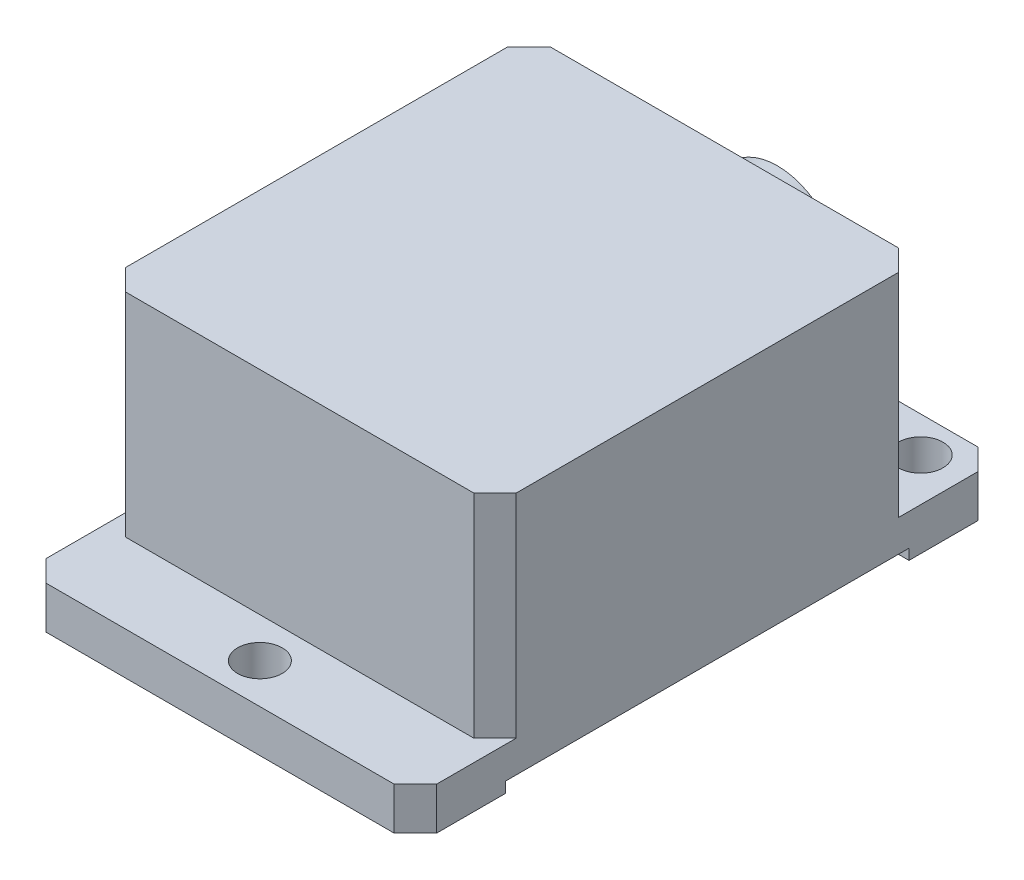
ISO-10303-21;
HEADER;
FILE_DESCRIPTION(('STEP AP214'),'2;1');
FILE_NAME('part.step','',(''),(''),'','','');
FILE_SCHEMA(('AUTOMOTIVE_DESIGN { 1 0 10303 214 1 1 1 1 }'));
ENDSEC;
DATA;
#1=APPLICATION_CONTEXT('core data for automotive mechanical design processes');
#2=APPLICATION_PROTOCOL_DEFINITION('international standard','automotive_design',2000,#1);
#3=PRODUCT_CONTEXT('',#1,'mechanical');
#4=PRODUCT('Part','Part','',(#3));
#5=PRODUCT_RELATED_PRODUCT_CATEGORY('part','',(#4));
#6=PRODUCT_DEFINITION_FORMATION('','',#4);
#7=PRODUCT_DEFINITION_CONTEXT('part definition',#1,'design');
#8=PRODUCT_DEFINITION('design','',#6,#7);
#9=PRODUCT_DEFINITION_SHAPE('','',#8);
#10=(LENGTH_UNIT() NAMED_UNIT(*) SI_UNIT(.MILLI.,.METRE.));
#11=(NAMED_UNIT(*) PLANE_ANGLE_UNIT() SI_UNIT($,.RADIAN.));
#12=(NAMED_UNIT(*) SI_UNIT($,.STERADIAN.) SOLID_ANGLE_UNIT());
#13=UNCERTAINTY_MEASURE_WITH_UNIT(LENGTH_MEASURE(1.E-05),#10,'distance_accuracy_value','');
#14=(GEOMETRIC_REPRESENTATION_CONTEXT(3) GLOBAL_UNCERTAINTY_ASSIGNED_CONTEXT((#13)) GLOBAL_UNIT_ASSIGNED_CONTEXT((#10,
#11,#12)) REPRESENTATION_CONTEXT('',''));
#15=CARTESIAN_POINT('',(0.,0.,0.));
#16=DIRECTION('',(0.,0.,1.));
#17=DIRECTION('',(1.,0.,0.));
#18=AXIS2_PLACEMENT_3D('',#15,#16,#17);
#19=CARTESIAN_POINT('',(0.,0.,0.));
#20=DIRECTION('',(0.,-1.,0.));
#21=DIRECTION('',(0.,0.,-1.));
#22=AXIS2_PLACEMENT_3D('',#19,#20,#21);
#23=PLANE('',#22);
#24=CARTESIAN_POINT('',(18.4,0.,-3.75));
#25=DIRECTION('',(0.,1.,0.));
#26=DIRECTION('',(0.,0.,1.));
#27=AXIS2_PLACEMENT_3D('',#24,#25,#26);
#28=CIRCLE('',#27,2.1);
#29=CARTESIAN_POINT('',(18.4,0.,-1.65));
#30=VERTEX_POINT('',#29);
#31=EDGE_CURVE('E370',#30,#30,#28,.T.);
#32=ORIENTED_EDGE('',*,*,#31,.T.);
#33=EDGE_LOOP('',(#32));
#34=FACE_BOUND('',#33,.T.);
#35=DIRECTION('',(1.,0.,0.));
#36=VECTOR('',#35,1.);
#37=CARTESIAN_POINT('',(0.,0.,0.));
#38=LINE('',#37,#36);
#39=CARTESIAN_POINT('',(2.00000000000001,0.,0.));
#40=VERTEX_POINT('',#39);
#41=CARTESIAN_POINT('',(34.8,0.,0.));
#42=VERTEX_POINT('',#41);
#43=EDGE_CURVE('E212',#40,#42,#38,.T.);
#44=ORIENTED_EDGE('',*,*,#43,.F.);
#45=DIRECTION('',(0.707106781186546,0.,0.707106781186549));
#46=VECTOR('',#45,1.);
#47=CARTESIAN_POINT('',(1.00000000000001,0.,-1.));
#48=LINE('',#47,#46);
#49=CARTESIAN_POINT('',(0.,0.,-2.00000000000002));
#50=VERTEX_POINT('',#49);
#51=EDGE_CURVE('E66',#40,#50,#48,.F.);
#52=ORIENTED_EDGE('',*,*,#51,.T.);
#53=DIRECTION('',(0.,0.,1.));
#54=VECTOR('',#53,1.);
#55=CARTESIAN_POINT('',(0.,0.,0.));
#56=LINE('',#55,#54);
#57=CARTESIAN_POINT('',(0.,0.,-8.5));
#58=VERTEX_POINT('',#57);
#59=EDGE_CURVE('E199',#58,#50,#56,.T.);
#60=ORIENTED_EDGE('',*,*,#59,.F.);
#61=DIRECTION('',(1.,0.,0.));
#62=VECTOR('',#61,1.);
#63=CARTESIAN_POINT('',(0.,0.,-8.5));
#64=LINE('',#63,#62);
#65=CARTESIAN_POINT('',(36.8,0.,-8.5));
#66=VERTEX_POINT('',#65);
#67=EDGE_CURVE('E183',#58,#66,#64,.T.);
#68=ORIENTED_EDGE('',*,*,#67,.T.);
#69=DIRECTION('',(0.,0.,-1.));
#70=VECTOR('',#69,1.);
#71=CARTESIAN_POINT('',(36.8,0.,0.));
#72=LINE('',#71,#70);
#73=CARTESIAN_POINT('',(36.8,0.,-2.00000000000001));
#74=VERTEX_POINT('',#73);
#75=EDGE_CURVE('E222',#74,#66,#72,.T.);
#76=ORIENTED_EDGE('',*,*,#75,.F.);
#77=DIRECTION('',(0.707106781186549,0.,-0.707106781186546));
#78=VECTOR('',#77,1.);
#79=CARTESIAN_POINT('',(17.3999999999999,0.,17.4));
#80=LINE('',#79,#78);
#81=EDGE_CURVE('E58',#74,#42,#80,.F.);
#82=ORIENTED_EDGE('',*,*,#81,.T.);
#83=EDGE_LOOP('',(#44,#52,#60,#68,#76,#82));
#84=FACE_BOUND('',#83,.T.);
#85=ADVANCED_FACE('F41',(#34,#84),#23,.T.);
#86=CARTESIAN_POINT('',(0.,24.,0.));
#87=DIRECTION('',(1.,0.,0.));
#88=DIRECTION('',(0.,0.,-1.));
#89=AXIS2_PLACEMENT_3D('',#86,#87,#88);
#90=PLANE('',#89);
#91=DIRECTION('',(0.,0.,-1.));
#92=VECTOR('',#91,1.);
#93=CARTESIAN_POINT('',(0.,4.,-55.));
#94=LINE('',#93,#92);
#95=CARTESIAN_POINT('',(0.,4.,-45.5));
#96=VERTEX_POINT('',#95);
#97=CARTESIAN_POINT('',(0.,4.,-53.));
#98=VERTEX_POINT('',#97);
#99=EDGE_CURVE('E378',#96,#98,#94,.T.);
#100=ORIENTED_EDGE('',*,*,#99,.T.);
#101=DIRECTION('',(0.,-1.,0.));
#102=VECTOR('',#101,1.);
#103=CARTESIAN_POINT('',(0.,24.,-53.));
#104=LINE('',#103,#102);
#105=CARTESIAN_POINT('',(0.,0.,-53.));
#106=VERTEX_POINT('',#105);
#107=EDGE_CURVE('E241',#98,#106,#104,.T.);
#108=ORIENTED_EDGE('',*,*,#107,.T.);
#109=CARTESIAN_POINT('',(0.,0.,-46.5));
#110=VERTEX_POINT('',#109);
#111=EDGE_CURVE('E207',#106,#110,#56,.T.);
#112=ORIENTED_EDGE('',*,*,#111,.T.);
#113=DIRECTION('',(0.,1.,0.));
#114=VECTOR('',#113,1.);
#115=CARTESIAN_POINT('',(0.,0.,-46.5));
#116=LINE('',#115,#114);
#117=CARTESIAN_POINT('',(0.,1.,-46.5));
#118=VERTEX_POINT('',#117);
#119=EDGE_CURVE('E203',#110,#118,#116,.T.);
#120=ORIENTED_EDGE('',*,*,#119,.T.);
#121=DIRECTION('',(0.,0.,1.));
#122=VECTOR('',#121,1.);
#123=CARTESIAN_POINT('',(0.,1.,-8.5));
#124=LINE('',#123,#122);
#125=CARTESIAN_POINT('',(0.,1.,-8.5));
#126=VERTEX_POINT('',#125);
#127=EDGE_CURVE('E193',#118,#126,#124,.T.);
#128=ORIENTED_EDGE('',*,*,#127,.T.);
#129=DIRECTION('',(0.,-1.,0.));
#130=VECTOR('',#129,1.);
#131=CARTESIAN_POINT('',(0.,0.,-8.5));
#132=LINE('',#131,#130);
#133=EDGE_CURVE('E186',#126,#58,#132,.T.);
#134=ORIENTED_EDGE('',*,*,#133,.T.);
#135=ORIENTED_EDGE('',*,*,#59,.T.);
#136=DIRECTION('',(0.,1.,0.));
#137=VECTOR('',#136,1.);
#138=CARTESIAN_POINT('',(0.,24.,-2.00000000000002));
#139=LINE('',#138,#137);
#140=CARTESIAN_POINT('',(0.,4.,-2.00000000000002));
#141=VERTEX_POINT('',#140);
#142=EDGE_CURVE('E230',#50,#141,#139,.T.);
#143=ORIENTED_EDGE('',*,*,#142,.T.);
#144=DIRECTION('',(0.,0.,-1.));
#145=VECTOR('',#144,1.);
#146=CARTESIAN_POINT('',(0.,4.,0.));
#147=LINE('',#146,#145);
#148=CARTESIAN_POINT('',(0.,4.,-9.50000000000001));
#149=VERTEX_POINT('',#148);
#150=EDGE_CURVE('E337',#141,#149,#147,.T.);
#151=ORIENTED_EDGE('',*,*,#150,.T.);
#152=DIRECTION('',(0.,1.,0.));
#153=VECTOR('',#152,1.);
#154=CARTESIAN_POINT('',(0.,24.,-9.50000000000001));
#155=LINE('',#154,#153);
#156=CARTESIAN_POINT('',(0.,24.,-9.50000000000001));
#157=VERTEX_POINT('',#156);
#158=EDGE_CURVE('E233',#149,#157,#155,.T.);
#159=ORIENTED_EDGE('',*,*,#158,.T.);
#160=DIRECTION('',(0.,0.,1.));
#161=VECTOR('',#160,1.);
#162=CARTESIAN_POINT('',(0.,24.,0.));
#163=LINE('',#162,#161);
#164=CARTESIAN_POINT('',(0.,24.,-45.5));
#165=VERTEX_POINT('',#164);
#166=EDGE_CURVE('E229',#165,#157,#163,.T.);
#167=ORIENTED_EDGE('',*,*,#166,.F.);
#168=DIRECTION('',(0.,-1.,0.));
#169=VECTOR('',#168,1.);
#170=CARTESIAN_POINT('',(0.,24.,-45.5));
#171=LINE('',#170,#169);
#172=EDGE_CURVE('E237',#165,#96,#171,.T.);
#173=ORIENTED_EDGE('',*,*,#172,.T.);
#174=EDGE_LOOP('',(#100,#108,#112,#120,#128,#134,#135,#143,#151,#159,#167,#173));
#175=FACE_BOUND('',#174,.T.);
#176=ADVANCED_FACE('F198',(#175),#90,.F.);
#177=CARTESIAN_POINT('',(0.,24.,0.));
#178=DIRECTION('',(0.,0.,-1.));
#179=DIRECTION('',(-1.,0.,0.));
#180=AXIS2_PLACEMENT_3D('',#177,#178,#179);
#181=PLANE('',#180);
#182=DIRECTION('',(1.,0.,0.));
#183=VECTOR('',#182,1.);
#184=CARTESIAN_POINT('',(0.,4.,0.));
#185=LINE('',#184,#183);
#186=CARTESIAN_POINT('',(2.00000000000001,4.,0.));
#187=VERTEX_POINT('',#186);
#188=CARTESIAN_POINT('',(34.8,4.,0.));
#189=VERTEX_POINT('',#188);
#190=EDGE_CURVE('E362',#187,#189,#185,.T.);
#191=ORIENTED_EDGE('',*,*,#190,.F.);
#192=DIRECTION('',(0.,-1.,0.));
#193=VECTOR('',#192,1.);
#194=CARTESIAN_POINT('',(2.00000000000001,24.,0.));
#195=LINE('',#194,#193);
#196=EDGE_CURVE('E307',#187,#40,#195,.T.);
#197=ORIENTED_EDGE('',*,*,#196,.T.);
#198=ORIENTED_EDGE('',*,*,#43,.T.);
#199=DIRECTION('',(0.,1.,0.));
#200=VECTOR('',#199,1.);
#201=CARTESIAN_POINT('',(34.8,24.,0.));
#202=LINE('',#201,#200);
#203=EDGE_CURVE('E304',#42,#189,#202,.T.);
#204=ORIENTED_EDGE('',*,*,#203,.T.);
#205=EDGE_LOOP('',(#191,#197,#198,#204));
#206=FACE_BOUND('',#205,.T.);
#207=ADVANCED_FACE('F494',(#206),#181,.F.);
#208=CARTESIAN_POINT('',(36.8,24.,0.));
#209=DIRECTION('',(-1.,0.,0.));
#210=DIRECTION('',(0.,0.,1.));
#211=AXIS2_PLACEMENT_3D('',#208,#209,#210);
#212=PLANE('',#211);
#213=CARTESIAN_POINT('',(36.8,0.,-46.5));
#214=VERTEX_POINT('',#213);
#215=CARTESIAN_POINT('',(36.8,0.,-53.));
#216=VERTEX_POINT('',#215);
#217=EDGE_CURVE('E221',#214,#216,#72,.T.);
#218=ORIENTED_EDGE('',*,*,#217,.T.);
#219=DIRECTION('',(0.,1.,0.));
#220=VECTOR('',#219,1.);
#221=CARTESIAN_POINT('',(36.8,24.,-53.));
#222=LINE('',#221,#220);
#223=CARTESIAN_POINT('',(36.8,4.,-53.));
#224=VERTEX_POINT('',#223);
#225=EDGE_CURVE('E294',#216,#224,#222,.T.);
#226=ORIENTED_EDGE('',*,*,#225,.T.);
#227=DIRECTION('',(0.,0.,-1.));
#228=VECTOR('',#227,1.);
#229=CARTESIAN_POINT('',(36.8,4.,-55.));
#230=LINE('',#229,#228);
#231=CARTESIAN_POINT('',(36.8,4.,-45.5));
#232=VERTEX_POINT('',#231);
#233=EDGE_CURVE('E366',#232,#224,#230,.T.);
#234=ORIENTED_EDGE('',*,*,#233,.F.);
#235=DIRECTION('',(0.,1.,0.));
#236=VECTOR('',#235,1.);
#237=CARTESIAN_POINT('',(36.8,24.,-45.5));
#238=LINE('',#237,#236);
#239=CARTESIAN_POINT('',(36.8,24.,-45.5));
#240=VERTEX_POINT('',#239);
#241=EDGE_CURVE('E291',#232,#240,#238,.T.);
#242=ORIENTED_EDGE('',*,*,#241,.T.);
#243=DIRECTION('',(0.,0.,-1.));
#244=VECTOR('',#243,1.);
#245=CARTESIAN_POINT('',(36.8,24.,0.));
#246=LINE('',#245,#244);
#247=CARTESIAN_POINT('',(36.8,24.,-9.5));
#248=VERTEX_POINT('',#247);
#249=EDGE_CURVE('E217',#248,#240,#246,.T.);
#250=ORIENTED_EDGE('',*,*,#249,.F.);
#251=DIRECTION('',(0.,-1.,0.));
#252=VECTOR('',#251,1.);
#253=CARTESIAN_POINT('',(36.8,24.,-9.5));
#254=LINE('',#253,#252);
#255=CARTESIAN_POINT('',(36.8,4.,-9.5));
#256=VERTEX_POINT('',#255);
#257=EDGE_CURVE('E287',#248,#256,#254,.T.);
#258=ORIENTED_EDGE('',*,*,#257,.T.);
#259=DIRECTION('',(0.,0.,-1.));
#260=VECTOR('',#259,1.);
#261=CARTESIAN_POINT('',(36.8,4.,0.));
#262=LINE('',#261,#260);
#263=CARTESIAN_POINT('',(36.8,4.,-2.00000000000001));
#264=VERTEX_POINT('',#263);
#265=EDGE_CURVE('E367',#264,#256,#262,.T.);
#266=ORIENTED_EDGE('',*,*,#265,.F.);
#267=DIRECTION('',(0.,-1.,0.));
#268=VECTOR('',#267,1.);
#269=CARTESIAN_POINT('',(36.8,24.,-2.00000000000001));
#270=LINE('',#269,#268);
#271=EDGE_CURVE('E283',#264,#74,#270,.T.);
#272=ORIENTED_EDGE('',*,*,#271,.T.);
#273=ORIENTED_EDGE('',*,*,#75,.T.);
#274=DIRECTION('',(0.,-1.,0.));
#275=VECTOR('',#274,1.);
#276=CARTESIAN_POINT('',(36.8,0.,-8.5));
#277=LINE('',#276,#275);
#278=CARTESIAN_POINT('',(36.8,1.,-8.5));
#279=VERTEX_POINT('',#278);
#280=EDGE_CURVE('E189',#279,#66,#277,.T.);
#281=ORIENTED_EDGE('',*,*,#280,.F.);
#282=DIRECTION('',(0.,0.,1.));
#283=VECTOR('',#282,1.);
#284=CARTESIAN_POINT('',(36.8,1.,-8.5));
#285=LINE('',#284,#283);
#286=CARTESIAN_POINT('',(36.8,1.,-46.5));
#287=VERTEX_POINT('',#286);
#288=EDGE_CURVE('E204',#287,#279,#285,.T.);
#289=ORIENTED_EDGE('',*,*,#288,.F.);
#290=DIRECTION('',(0.,1.,0.));
#291=VECTOR('',#290,1.);
#292=CARTESIAN_POINT('',(36.8,0.,-46.5));
#293=LINE('',#292,#291);
#294=EDGE_CURVE('E398',#214,#287,#293,.T.);
#295=ORIENTED_EDGE('',*,*,#294,.F.);
#296=EDGE_LOOP('',(#218,#226,#234,#242,#250,#258,#266,#272,#273,#281,#289,#295));
#297=FACE_BOUND('',#296,.T.);
#298=ADVANCED_FACE('F479',(#297),#212,.F.);
#299=CARTESIAN_POINT('',(0.,24.,-55.));
#300=DIRECTION('',(0.,0.,1.));
#301=DIRECTION('',(1.,0.,0.));
#302=AXIS2_PLACEMENT_3D('',#299,#300,#301);
#303=PLANE('',#302);
#304=DIRECTION('',(-1.,0.,0.));
#305=VECTOR('',#304,1.);
#306=CARTESIAN_POINT('',(0.,0.,-55.));
#307=LINE('',#306,#305);
#308=CARTESIAN_POINT('',(34.8,0.,-55.));
#309=VERTEX_POINT('',#308);
#310=CARTESIAN_POINT('',(2.,0.,-55.));
#311=VERTEX_POINT('',#310);
#312=EDGE_CURVE('E225',#309,#311,#307,.T.);
#313=ORIENTED_EDGE('',*,*,#312,.T.);
#314=DIRECTION('',(0.,1.,0.));
#315=VECTOR('',#314,1.);
#316=CARTESIAN_POINT('',(2.,24.,-55.));
#317=LINE('',#316,#315);
#318=CARTESIAN_POINT('',(2.,4.,-55.));
#319=VERTEX_POINT('',#318);
#320=EDGE_CURVE('E255',#311,#319,#317,.T.);
#321=ORIENTED_EDGE('',*,*,#320,.T.);
#322=DIRECTION('',(1.,0.,0.));
#323=VECTOR('',#322,1.);
#324=CARTESIAN_POINT('',(0.,4.,-55.));
#325=LINE('',#324,#323);
#326=CARTESIAN_POINT('',(34.8,4.,-55.));
#327=VERTEX_POINT('',#326);
#328=EDGE_CURVE('E382',#319,#327,#325,.T.);
#329=ORIENTED_EDGE('',*,*,#328,.T.);
#330=DIRECTION('',(0.,-1.,0.));
#331=VECTOR('',#330,1.);
#332=CARTESIAN_POINT('',(34.8,24.,-55.));
#333=LINE('',#332,#331);
#334=EDGE_CURVE('E251',#327,#309,#333,.T.);
#335=ORIENTED_EDGE('',*,*,#334,.T.);
#336=EDGE_LOOP('',(#313,#321,#329,#335));
#337=FACE_BOUND('',#336,.T.);
#338=ADVANCED_FACE('F468',(#337),#303,.F.);
#339=CARTESIAN_POINT('',(0.,24.,0.));
#340=DIRECTION('',(0.,-1.,0.));
#341=DIRECTION('',(0.,0.,-1.));
#342=AXIS2_PLACEMENT_3D('',#339,#340,#341);
#343=PLANE('',#342);
#344=DIRECTION('',(1.,0.,0.));
#345=VECTOR('',#344,1.);
#346=CARTESIAN_POINT('',(0.,24.,-47.5));
#347=LINE('',#346,#345);
#348=CARTESIAN_POINT('',(2.00000000000002,24.,-47.5));
#349=VERTEX_POINT('',#348);
#350=CARTESIAN_POINT('',(34.8,24.,-47.5));
#351=VERTEX_POINT('',#350);
#352=EDGE_CURVE('E373',#349,#351,#347,.T.);
#353=ORIENTED_EDGE('',*,*,#352,.F.);
#354=DIRECTION('',(0.707106781186549,0.,-0.707106781186546));
#355=VECTOR('',#354,1.);
#356=CARTESIAN_POINT('',(0.,24.,-45.5));
#357=LINE('',#356,#355);
#358=EDGE_CURVE('E280',#349,#165,#357,.F.);
#359=ORIENTED_EDGE('',*,*,#358,.T.);
#360=ORIENTED_EDGE('',*,*,#166,.T.);
#361=DIRECTION('',(-0.707106781186549,0.,-0.707106781186546));
#362=VECTOR('',#361,1.);
#363=CARTESIAN_POINT('',(0.,24.,-9.50000000000001));
#364=LINE('',#363,#362);
#365=CARTESIAN_POINT('',(2.00000000000002,24.,-7.5));
#366=VERTEX_POINT('',#365);
#367=EDGE_CURVE('E271',#157,#366,#364,.F.);
#368=ORIENTED_EDGE('',*,*,#367,.T.);
#369=DIRECTION('',(1.,0.,0.));
#370=VECTOR('',#369,1.);
#371=CARTESIAN_POINT('',(0.,24.,-7.5));
#372=LINE('',#371,#370);
#373=CARTESIAN_POINT('',(34.8,24.,-7.5));
#374=VERTEX_POINT('',#373);
#375=EDGE_CURVE('E359',#366,#374,#372,.T.);
#376=ORIENTED_EDGE('',*,*,#375,.T.);
#377=DIRECTION('',(-0.707106781186546,0.,0.707106781186549));
#378=VECTOR('',#377,1.);
#379=CARTESIAN_POINT('',(34.8,24.,-7.5));
#380=LINE('',#379,#378);
#381=EDGE_CURVE('E274',#374,#248,#380,.F.);
#382=ORIENTED_EDGE('',*,*,#381,.T.);
#383=ORIENTED_EDGE('',*,*,#249,.T.);
#384=DIRECTION('',(0.707106781186546,0.,0.707106781186549));
#385=VECTOR('',#384,1.);
#386=CARTESIAN_POINT('',(34.8,24.,-47.5));
#387=LINE('',#386,#385);
#388=EDGE_CURVE('E277',#240,#351,#387,.F.);
#389=ORIENTED_EDGE('',*,*,#388,.T.);
#390=EDGE_LOOP('',(#353,#359,#360,#368,#376,#382,#383,#389));
#391=FACE_BOUND('',#390,.T.);
#392=ADVANCED_FACE('F349',(#391),#343,.F.);
#393=CARTESIAN_POINT('',(32.75,0.,-51.65));
#394=DIRECTION('',(0.,1.,0.));
#395=DIRECTION('',(0.,0.,1.));
#396=AXIS2_PLACEMENT_3D('',#393,#394,#395);
#397=CIRCLE('',#396,2.1);
#398=CARTESIAN_POINT('',(32.75,0.,-49.55));
#399=VERTEX_POINT('',#398);
#400=EDGE_CURVE('E421',#399,#399,#397,.T.);
#401=ORIENTED_EDGE('',*,*,#400,.T.);
#402=EDGE_LOOP('',(#401));
#403=FACE_BOUND('',#402,.T.);
#404=CARTESIAN_POINT('',(4.05,0.,-51.65));
#405=DIRECTION('',(0.,1.,0.));
#406=DIRECTION('',(0.,0.,1.));
#407=AXIS2_PLACEMENT_3D('',#404,#405,#406);
#408=CIRCLE('',#407,2.1);
#409=CARTESIAN_POINT('',(4.05,0.,-49.55));
#410=VERTEX_POINT('',#409);
#411=EDGE_CURVE('E412',#410,#410,#408,.T.);
#412=ORIENTED_EDGE('',*,*,#411,.T.);
#413=EDGE_LOOP('',(#412));
#414=FACE_BOUND('',#413,.T.);
#415=ORIENTED_EDGE('',*,*,#111,.F.);
#416=DIRECTION('',(-0.707106781186549,0.,0.707106781186546));
#417=VECTOR('',#416,1.);
#418=CARTESIAN_POINT('',(-26.5,0.,-26.5000000000001));
#419=LINE('',#418,#417);
#420=EDGE_CURVE('E248',#106,#311,#419,.F.);
#421=ORIENTED_EDGE('',*,*,#420,.T.);
#422=ORIENTED_EDGE('',*,*,#312,.F.);
#423=DIRECTION('',(-0.707106781186546,0.,-0.707106781186549));
#424=VECTOR('',#423,1.);
#425=CARTESIAN_POINT('',(44.9000000000001,0.,-44.8999999999999));
#426=LINE('',#425,#424);
#427=EDGE_CURVE('E245',#309,#216,#426,.F.);
#428=ORIENTED_EDGE('',*,*,#427,.T.);
#429=ORIENTED_EDGE('',*,*,#217,.F.);
#430=DIRECTION('',(1.,0.,0.));
#431=VECTOR('',#430,1.);
#432=CARTESIAN_POINT('',(0.,0.,-46.5));
#433=LINE('',#432,#431);
#434=EDGE_CURVE('E192',#110,#214,#433,.T.);
#435=ORIENTED_EDGE('',*,*,#434,.F.);
#436=EDGE_LOOP('',(#415,#421,#422,#428,#429,#435));
#437=FACE_BOUND('',#436,.T.);
#438=ADVANCED_FACE('F465',(#403,#414,#437),#23,.T.);
#439=CARTESIAN_POINT('',(0.,0.,-8.5));
#440=DIRECTION('',(0.,0.,1.));
#441=DIRECTION('',(1.,0.,0.));
#442=AXIS2_PLACEMENT_3D('',#439,#440,#441);
#443=PLANE('',#442);
#444=ORIENTED_EDGE('',*,*,#280,.T.);
#445=ORIENTED_EDGE('',*,*,#67,.F.);
#446=ORIENTED_EDGE('',*,*,#133,.F.);
#447=DIRECTION('',(1.,0.,0.));
#448=VECTOR('',#447,1.);
#449=CARTESIAN_POINT('',(0.,1.,-8.5));
#450=LINE('',#449,#448);
#451=EDGE_CURVE('E208',#126,#279,#450,.T.);
#452=ORIENTED_EDGE('',*,*,#451,.T.);
#453=EDGE_LOOP('',(#444,#445,#446,#452));
#454=FACE_BOUND('',#453,.T.);
#455=ADVANCED_FACE('F185',(#454),#443,.F.);
#456=CARTESIAN_POINT('',(0.,1.,-8.5));
#457=DIRECTION('',(0.,1.,0.));
#458=DIRECTION('',(0.,0.,1.));
#459=AXIS2_PLACEMENT_3D('',#456,#457,#458);
#460=PLANE('',#459);
#461=ORIENTED_EDGE('',*,*,#288,.T.);
#462=ORIENTED_EDGE('',*,*,#451,.F.);
#463=ORIENTED_EDGE('',*,*,#127,.F.);
#464=DIRECTION('',(1.,0.,0.));
#465=VECTOR('',#464,1.);
#466=CARTESIAN_POINT('',(0.,1.,-46.5));
#467=LINE('',#466,#465);
#468=EDGE_CURVE('E213',#118,#287,#467,.T.);
#469=ORIENTED_EDGE('',*,*,#468,.T.);
#470=EDGE_LOOP('',(#461,#462,#463,#469));
#471=FACE_BOUND('',#470,.T.);
#472=ADVANCED_FACE('F486',(#471),#460,.F.);
#473=CARTESIAN_POINT('',(0.,0.,-46.5));
#474=DIRECTION('',(0.,0.,-1.));
#475=DIRECTION('',(-1.,0.,0.));
#476=AXIS2_PLACEMENT_3D('',#473,#474,#475);
#477=PLANE('',#476);
#478=ORIENTED_EDGE('',*,*,#294,.T.);
#479=ORIENTED_EDGE('',*,*,#468,.F.);
#480=ORIENTED_EDGE('',*,*,#119,.F.);
#481=ORIENTED_EDGE('',*,*,#434,.T.);
#482=EDGE_LOOP('',(#478,#479,#480,#481));
#483=FACE_BOUND('',#482,.T.);
#484=ADVANCED_FACE('F483',(#483),#477,.F.);
#485=CARTESIAN_POINT('',(0.,4.,0.));
#486=DIRECTION('',(0.,-1.,0.));
#487=DIRECTION('',(0.,0.,-1.));
#488=AXIS2_PLACEMENT_3D('',#485,#486,#487);
#489=PLANE('',#488);
#490=CARTESIAN_POINT('',(18.4,4.,-3.75));
#491=DIRECTION('',(0.,1.,0.));
#492=DIRECTION('',(0.,0.,1.));
#493=AXIS2_PLACEMENT_3D('',#490,#491,#492);
#494=CIRCLE('',#493,2.1);
#495=CARTESIAN_POINT('',(18.4,4.,-1.65));
#496=VERTEX_POINT('',#495);
#497=EDGE_CURVE('E425',#496,#496,#494,.T.);
#498=ORIENTED_EDGE('',*,*,#497,.F.);
#499=EDGE_LOOP('',(#498));
#500=FACE_BOUND('',#499,.T.);
#501=ORIENTED_EDGE('',*,*,#150,.F.);
#502=DIRECTION('',(-0.707106781186546,0.,-0.707106781186549));
#503=VECTOR('',#502,1.);
#504=CARTESIAN_POINT('',(2.00000000000001,4.,0.));
#505=LINE('',#504,#503);
#506=EDGE_CURVE('E317',#141,#187,#505,.F.);
#507=ORIENTED_EDGE('',*,*,#506,.T.);
#508=ORIENTED_EDGE('',*,*,#190,.T.);
#509=DIRECTION('',(-0.707106781186549,0.,0.707106781186546));
#510=VECTOR('',#509,1.);
#511=CARTESIAN_POINT('',(36.8,4.,-2.00000000000001));
#512=LINE('',#511,#510);
#513=EDGE_CURVE('E314',#189,#264,#512,.F.);
#514=ORIENTED_EDGE('',*,*,#513,.T.);
#515=ORIENTED_EDGE('',*,*,#265,.T.);
#516=DIRECTION('',(0.707106781186546,0.,-0.707106781186549));
#517=VECTOR('',#516,1.);
#518=CARTESIAN_POINT('',(13.6500000000001,4.,13.65));
#519=LINE('',#518,#517);
#520=CARTESIAN_POINT('',(34.8,4.,-7.5));
#521=VERTEX_POINT('',#520);
#522=EDGE_CURVE('E327',#256,#521,#519,.F.);
#523=ORIENTED_EDGE('',*,*,#522,.T.);
#524=DIRECTION('',(1.,0.,0.));
#525=VECTOR('',#524,1.);
#526=CARTESIAN_POINT('',(0.,4.,-7.5));
#527=LINE('',#526,#525);
#528=CARTESIAN_POINT('',(2.00000000000002,4.,-7.5));
#529=VERTEX_POINT('',#528);
#530=EDGE_CURVE('E340',#529,#521,#527,.T.);
#531=ORIENTED_EDGE('',*,*,#530,.F.);
#532=DIRECTION('',(0.707106781186549,0.,0.707106781186546));
#533=VECTOR('',#532,1.);
#534=CARTESIAN_POINT('',(4.75,4.,-4.75000000000002));
#535=LINE('',#534,#533);
#536=EDGE_CURVE('E51',#529,#149,#535,.F.);
#537=ORIENTED_EDGE('',*,*,#536,.T.);
#538=EDGE_LOOP('',(#501,#507,#508,#514,#515,#523,#531,#537));
#539=FACE_BOUND('',#538,.T.);
#540=ADVANCED_FACE('F336',(#500,#539),#489,.F.);
#541=CARTESIAN_POINT('',(0.,4.,-7.5));
#542=DIRECTION('',(0.,0.,-1.));
#543=DIRECTION('',(-1.,0.,0.));
#544=AXIS2_PLACEMENT_3D('',#541,#542,#543);
#545=PLANE('',#544);
#546=ORIENTED_EDGE('',*,*,#530,.T.);
#547=DIRECTION('',(0.,1.,0.));
#548=VECTOR('',#547,1.);
#549=CARTESIAN_POINT('',(34.8,4.,-7.5));
#550=LINE('',#549,#548);
#551=EDGE_CURVE('E300',#521,#374,#550,.T.);
#552=ORIENTED_EDGE('',*,*,#551,.T.);
#553=ORIENTED_EDGE('',*,*,#375,.F.);
#554=DIRECTION('',(0.,-1.,0.));
#555=VECTOR('',#554,1.);
#556=CARTESIAN_POINT('',(2.00000000000002,4.,-7.5));
#557=LINE('',#556,#555);
#558=EDGE_CURVE('E297',#366,#529,#557,.T.);
#559=ORIENTED_EDGE('',*,*,#558,.T.);
#560=EDGE_LOOP('',(#546,#552,#553,#559));
#561=FACE_BOUND('',#560,.T.);
#562=ADVANCED_FACE('F531',(#561),#545,.F.);
#563=CARTESIAN_POINT('',(0.,4.,-55.));
#564=DIRECTION('',(0.,-1.,0.));
#565=DIRECTION('',(0.,0.,-1.));
#566=AXIS2_PLACEMENT_3D('',#563,#564,#565);
#567=PLANE('',#566);
#568=CARTESIAN_POINT('',(32.75,3.99999999999999,-51.65));
#569=DIRECTION('',(0.,1.,0.));
#570=DIRECTION('',(0.,0.,1.));
#571=AXIS2_PLACEMENT_3D('',#568,#569,#570);
#572=CIRCLE('',#571,2.1);
#573=CARTESIAN_POINT('',(32.75,3.99999999999999,-49.55));
#574=VERTEX_POINT('',#573);
#575=EDGE_CURVE('E417',#574,#574,#572,.T.);
#576=ORIENTED_EDGE('',*,*,#575,.F.);
#577=EDGE_LOOP('',(#576));
#578=FACE_BOUND('',#577,.T.);
#579=CARTESIAN_POINT('',(4.05,3.99999999999999,-51.65));
#580=DIRECTION('',(0.,1.,0.));
#581=DIRECTION('',(0.,0.,1.));
#582=AXIS2_PLACEMENT_3D('',#579,#580,#581);
#583=CIRCLE('',#582,2.1);
#584=CARTESIAN_POINT('',(4.05,3.99999999999999,-49.55));
#585=VERTEX_POINT('',#584);
#586=EDGE_CURVE('E408',#585,#585,#583,.T.);
#587=ORIENTED_EDGE('',*,*,#586,.F.);
#588=EDGE_LOOP('',(#587));
#589=FACE_BOUND('',#588,.T.);
#590=ORIENTED_EDGE('',*,*,#328,.F.);
#591=DIRECTION('',(0.707106781186549,0.,-0.707106781186546));
#592=VECTOR('',#591,1.);
#593=CARTESIAN_POINT('',(0.,4.,-53.));
#594=LINE('',#593,#592);
#595=EDGE_CURVE('E261',#319,#98,#594,.F.);
#596=ORIENTED_EDGE('',*,*,#595,.T.);
#597=ORIENTED_EDGE('',*,*,#99,.F.);
#598=DIRECTION('',(-0.707106781186549,0.,0.707106781186546));
#599=VECTOR('',#598,1.);
#600=CARTESIAN_POINT('',(4.75,4.,-50.25));
#601=LINE('',#600,#599);
#602=CARTESIAN_POINT('',(2.00000000000002,4.,-47.5));
#603=VERTEX_POINT('',#602);
#604=EDGE_CURVE('E320',#96,#603,#601,.F.);
#605=ORIENTED_EDGE('',*,*,#604,.T.);
#606=DIRECTION('',(1.,0.,0.));
#607=VECTOR('',#606,1.);
#608=CARTESIAN_POINT('',(0.,4.,-47.5));
#609=LINE('',#608,#607);
#610=CARTESIAN_POINT('',(34.8,4.,-47.5));
#611=VERTEX_POINT('',#610);
#612=EDGE_CURVE('E377',#603,#611,#609,.T.);
#613=ORIENTED_EDGE('',*,*,#612,.T.);
#614=DIRECTION('',(-0.707106781186546,0.,-0.707106781186549));
#615=VECTOR('',#614,1.);
#616=CARTESIAN_POINT('',(13.6500000000001,4.,-68.65));
#617=LINE('',#616,#615);
#618=EDGE_CURVE('E323',#611,#232,#617,.F.);
#619=ORIENTED_EDGE('',*,*,#618,.T.);
#620=ORIENTED_EDGE('',*,*,#233,.T.);
#621=DIRECTION('',(0.707106781186546,0.,0.707106781186549));
#622=VECTOR('',#621,1.);
#623=CARTESIAN_POINT('',(34.8,4.,-55.));
#624=LINE('',#623,#622);
#625=EDGE_CURVE('E258',#224,#327,#624,.F.);
#626=ORIENTED_EDGE('',*,*,#625,.T.);
#627=EDGE_LOOP('',(#590,#596,#597,#605,#613,#619,#620,#626));
#628=FACE_BOUND('',#627,.T.);
#629=ADVANCED_FACE('F448',(#578,#589,#628),#567,.F.);
#630=CARTESIAN_POINT('',(0.,4.,-47.5));
#631=DIRECTION('',(0.,0.,1.));
#632=DIRECTION('',(1.,0.,0.));
#633=AXIS2_PLACEMENT_3D('',#630,#631,#632);
#634=PLANE('',#633);
#635=CARTESIAN_POINT('',(18.4,14.,-47.5));
#636=DIRECTION('',(0.,0.,1.));
#637=DIRECTION('',(1.,0.,0.));
#638=AXIS2_PLACEMENT_3D('',#635,#636,#637);
#639=CIRCLE('',#638,6.);
#640=CARTESIAN_POINT('',(24.4,14.,-47.5));
#641=VERTEX_POINT('',#640);
#642=EDGE_CURVE('E11',#641,#641,#639,.F.);
#643=ORIENTED_EDGE('',*,*,#642,.F.);
#644=EDGE_LOOP('',(#643));
#645=FACE_BOUND('',#644,.T.);
#646=ORIENTED_EDGE('',*,*,#612,.F.);
#647=DIRECTION('',(0.,1.,0.));
#648=VECTOR('',#647,1.);
#649=CARTESIAN_POINT('',(2.00000000000002,4.,-47.5));
#650=LINE('',#649,#648);
#651=EDGE_CURVE('E268',#603,#349,#650,.T.);
#652=ORIENTED_EDGE('',*,*,#651,.T.);
#653=ORIENTED_EDGE('',*,*,#352,.T.);
#654=DIRECTION('',(0.,-1.,0.));
#655=VECTOR('',#654,1.);
#656=CARTESIAN_POINT('',(34.8,4.,-47.5));
#657=LINE('',#656,#655);
#658=EDGE_CURVE('E264',#351,#611,#657,.T.);
#659=ORIENTED_EDGE('',*,*,#658,.T.);
#660=EDGE_LOOP('',(#646,#652,#653,#659));
#661=FACE_BOUND('',#660,.T.);
#662=ADVANCED_FACE('F444',(#645,#661),#634,.F.);
#663=CARTESIAN_POINT('',(4.05,0.,-51.65));
#664=DIRECTION('',(0.,1.,0.));
#665=DIRECTION('',(0.,0.,1.));
#666=AXIS2_PLACEMENT_3D('',#663,#664,#665);
#667=CYLINDRICAL_SURFACE('',#666,2.1);
#668=ORIENTED_EDGE('',*,*,#411,.F.);
#669=EDGE_LOOP('',(#668));
#670=FACE_BOUND('',#669,.T.);
#671=ORIENTED_EDGE('',*,*,#586,.T.);
#672=EDGE_LOOP('',(#671));
#673=FACE_BOUND('',#672,.T.);
#674=ADVANCED_FACE('F447',(#670,#673),#667,.F.);
#675=CARTESIAN_POINT('',(32.75,0.,-51.65));
#676=DIRECTION('',(0.,1.,0.));
#677=DIRECTION('',(0.,0.,1.));
#678=AXIS2_PLACEMENT_3D('',#675,#676,#677);
#679=CYLINDRICAL_SURFACE('',#678,2.1);
#680=ORIENTED_EDGE('',*,*,#400,.F.);
#681=EDGE_LOOP('',(#680));
#682=FACE_BOUND('',#681,.T.);
#683=ORIENTED_EDGE('',*,*,#575,.T.);
#684=EDGE_LOOP('',(#683));
#685=FACE_BOUND('',#684,.T.);
#686=ADVANCED_FACE('F526',(#682,#685),#679,.F.);
#687=CARTESIAN_POINT('',(18.4,0.,-3.75));
#688=DIRECTION('',(0.,1.,0.));
#689=DIRECTION('',(0.,0.,1.));
#690=AXIS2_PLACEMENT_3D('',#687,#688,#689);
#691=CYLINDRICAL_SURFACE('',#690,2.1);
#692=ORIENTED_EDGE('',*,*,#31,.F.);
#693=EDGE_LOOP('',(#692));
#694=FACE_BOUND('',#693,.T.);
#695=ORIENTED_EDGE('',*,*,#497,.T.);
#696=EDGE_LOOP('',(#695));
#697=FACE_BOUND('',#696,.T.);
#698=ADVANCED_FACE('F575',(#694,#697),#691,.F.);
#699=CARTESIAN_POINT('',(0.,24.,-53.));
#700=DIRECTION('',(0.707106781186546,0.,0.707106781186549));
#701=DIRECTION('',(0.,-1.,0.));
#702=AXIS2_PLACEMENT_3D('',#699,#700,#701);
#703=PLANE('',#702);
#704=ORIENTED_EDGE('',*,*,#595,.F.);
#705=ORIENTED_EDGE('',*,*,#320,.F.);
#706=ORIENTED_EDGE('',*,*,#420,.F.);
#707=ORIENTED_EDGE('',*,*,#107,.F.);
#708=EDGE_LOOP('',(#704,#705,#706,#707));
#709=FACE_BOUND('',#708,.T.);
#710=ADVANCED_FACE('F461',(#709),#703,.F.);
#711=CARTESIAN_POINT('',(0.,24.,-45.5));
#712=DIRECTION('',(0.707106781186546,0.,0.707106781186549));
#713=DIRECTION('',(0.,-1.,0.));
#714=AXIS2_PLACEMENT_3D('',#711,#712,#713);
#715=PLANE('',#714);
#716=ORIENTED_EDGE('',*,*,#358,.F.);
#717=ORIENTED_EDGE('',*,*,#651,.F.);
#718=ORIENTED_EDGE('',*,*,#604,.F.);
#719=ORIENTED_EDGE('',*,*,#172,.F.);
#720=EDGE_LOOP('',(#716,#717,#718,#719));
#721=FACE_BOUND('',#720,.T.);
#722=ADVANCED_FACE('F456',(#721),#715,.F.);
#723=CARTESIAN_POINT('',(34.8,24.,-55.));
#724=DIRECTION('',(-0.707106781186549,0.,0.707106781186546));
#725=DIRECTION('',(0.,-1.,0.));
#726=AXIS2_PLACEMENT_3D('',#723,#724,#725);
#727=PLANE('',#726);
#728=ORIENTED_EDGE('',*,*,#625,.F.);
#729=ORIENTED_EDGE('',*,*,#225,.F.);
#730=ORIENTED_EDGE('',*,*,#427,.F.);
#731=ORIENTED_EDGE('',*,*,#334,.F.);
#732=EDGE_LOOP('',(#728,#729,#730,#731));
#733=FACE_BOUND('',#732,.T.);
#734=ADVANCED_FACE('F473',(#733),#727,.F.);
#735=CARTESIAN_POINT('',(34.8,4.,-47.5));
#736=DIRECTION('',(-0.707106781186549,0.,0.707106781186546));
#737=DIRECTION('',(0.,-1.,0.));
#738=AXIS2_PLACEMENT_3D('',#735,#736,#737);
#739=PLANE('',#738);
#740=ORIENTED_EDGE('',*,*,#388,.F.);
#741=ORIENTED_EDGE('',*,*,#241,.F.);
#742=ORIENTED_EDGE('',*,*,#618,.F.);
#743=ORIENTED_EDGE('',*,*,#658,.F.);
#744=EDGE_LOOP('',(#740,#741,#742,#743));
#745=FACE_BOUND('',#744,.T.);
#746=ADVANCED_FACE('F539',(#745),#739,.F.);
#747=CARTESIAN_POINT('',(34.8,4.,-7.5));
#748=DIRECTION('',(-0.707106781186549,0.,-0.707106781186546));
#749=DIRECTION('',(0.,1.,0.));
#750=AXIS2_PLACEMENT_3D('',#747,#748,#749);
#751=PLANE('',#750);
#752=ORIENTED_EDGE('',*,*,#522,.F.);
#753=ORIENTED_EDGE('',*,*,#257,.F.);
#754=ORIENTED_EDGE('',*,*,#381,.F.);
#755=ORIENTED_EDGE('',*,*,#551,.F.);
#756=EDGE_LOOP('',(#752,#753,#754,#755));
#757=FACE_BOUND('',#756,.T.);
#758=ADVANCED_FACE('F501',(#757),#751,.F.);
#759=CARTESIAN_POINT('',(0.,24.,-9.50000000000001));
#760=DIRECTION('',(0.707106781186546,0.,-0.707106781186549));
#761=DIRECTION('',(0.,1.,0.));
#762=AXIS2_PLACEMENT_3D('',#759,#760,#761);
#763=PLANE('',#762);
#764=ORIENTED_EDGE('',*,*,#536,.F.);
#765=ORIENTED_EDGE('',*,*,#558,.F.);
#766=ORIENTED_EDGE('',*,*,#367,.F.);
#767=ORIENTED_EDGE('',*,*,#158,.F.);
#768=EDGE_LOOP('',(#764,#765,#766,#767));
#769=FACE_BOUND('',#768,.T.);
#770=ADVANCED_FACE('F343',(#769),#763,.F.);
#771=CARTESIAN_POINT('',(2.00000000000001,24.,0.));
#772=DIRECTION('',(0.707106781186549,0.,-0.707106781186546));
#773=DIRECTION('',(0.,-1.,0.));
#774=AXIS2_PLACEMENT_3D('',#771,#772,#773);
#775=PLANE('',#774);
#776=ORIENTED_EDGE('',*,*,#506,.F.);
#777=ORIENTED_EDGE('',*,*,#142,.F.);
#778=ORIENTED_EDGE('',*,*,#51,.F.);
#779=ORIENTED_EDGE('',*,*,#196,.F.);
#780=EDGE_LOOP('',(#776,#777,#778,#779));
#781=FACE_BOUND('',#780,.T.);
#782=ADVANCED_FACE('F495',(#781),#775,.F.);
#783=CARTESIAN_POINT('',(36.8,24.,-2.00000000000001));
#784=DIRECTION('',(-0.707106781186546,0.,-0.707106781186549));
#785=DIRECTION('',(0.,-1.,0.));
#786=AXIS2_PLACEMENT_3D('',#783,#784,#785);
#787=PLANE('',#786);
#788=ORIENTED_EDGE('',*,*,#513,.F.);
#789=ORIENTED_EDGE('',*,*,#203,.F.);
#790=ORIENTED_EDGE('',*,*,#81,.F.);
#791=ORIENTED_EDGE('',*,*,#271,.F.);
#792=EDGE_LOOP('',(#788,#789,#790,#791));
#793=FACE_BOUND('',#792,.T.);
#794=ADVANCED_FACE('F44',(#793),#787,.F.);
#795=CARTESIAN_POINT('',(18.4,14.,-52.5));
#796=DIRECTION('',(0.,0.,1.));
#797=DIRECTION('',(1.,0.,0.));
#798=AXIS2_PLACEMENT_3D('',#795,#796,#797);
#799=CYLINDRICAL_SURFACE('',#798,6.);
#800=CARTESIAN_POINT('',(18.4,14.,-52.5));
#801=DIRECTION('',(0.,0.,-1.));
#802=DIRECTION('',(-1.,0.,0.));
#803=AXIS2_PLACEMENT_3D('',#800,#801,#802);
#804=CIRCLE('',#803,6.);
#805=CARTESIAN_POINT('',(12.4,14.,-52.5));
#806=VERTEX_POINT('',#805);
#807=EDGE_CURVE('E413',#806,#806,#804,.T.);
#808=ORIENTED_EDGE('',*,*,#807,.F.);
#809=EDGE_LOOP('',(#808));
#810=FACE_BOUND('',#809,.T.);
#811=ORIENTED_EDGE('',*,*,#642,.T.);
#812=EDGE_LOOP('',(#811));
#813=FACE_BOUND('',#812,.T.);
#814=ADVANCED_FACE('F438',(#810,#813),#799,.T.);
#815=CARTESIAN_POINT('',(18.4,14.,-52.5));
#816=DIRECTION('',(0.,0.,-1.));
#817=DIRECTION('',(-1.,0.,0.));
#818=AXIS2_PLACEMENT_3D('',#815,#816,#817);
#819=PLANE('',#818);
#820=ORIENTED_EDGE('',*,*,#807,.T.);
#821=EDGE_LOOP('',(#820));
#822=FACE_BOUND('',#821,.T.);
#823=ADVANCED_FACE('F436',(#822),#819,.T.);
#824=CLOSED_SHELL('',(#85,#176,#207,#298,#338,#392,#438,#455,#472,#484,#540,#562,#629,#662,#674,
#686,#698,#710,#722,#734,#746,#758,#770,#782,#794,#814,#823));
#825=MANIFOLD_SOLID_BREP('B2',#824);
#826=ADVANCED_BREP_SHAPE_REPRESENTATION('',(#18,#825),#14);
#827=SHAPE_DEFINITION_REPRESENTATION(#9,#826);
ENDSEC;
END-ISO-10303-21;
